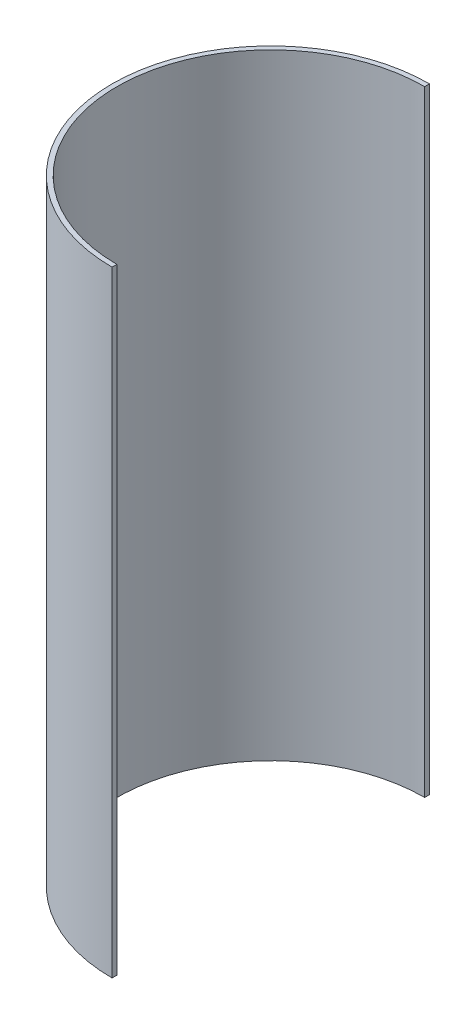
ISO-10303-21;
HEADER;
FILE_DESCRIPTION(('STEP AP214'),'2;1');
FILE_NAME('part.step','',(''),(''),'','','');
FILE_SCHEMA(('AUTOMOTIVE_DESIGN { 1 0 10303 214 1 1 1 1 }'));
ENDSEC;
DATA;
#1=APPLICATION_CONTEXT('core data for automotive mechanical design processes');
#2=APPLICATION_PROTOCOL_DEFINITION('international standard','automotive_design',2000,#1);
#3=PRODUCT_CONTEXT('',#1,'mechanical');
#4=PRODUCT('Part','Part','',(#3));
#5=PRODUCT_RELATED_PRODUCT_CATEGORY('part','',(#4));
#6=PRODUCT_DEFINITION_FORMATION('','',#4);
#7=PRODUCT_DEFINITION_CONTEXT('part definition',#1,'design');
#8=PRODUCT_DEFINITION('design','',#6,#7);
#9=PRODUCT_DEFINITION_SHAPE('','',#8);
#10=(LENGTH_UNIT() NAMED_UNIT(*) SI_UNIT(.MILLI.,.METRE.));
#11=(NAMED_UNIT(*) PLANE_ANGLE_UNIT() SI_UNIT($,.RADIAN.));
#12=(NAMED_UNIT(*) SI_UNIT($,.STERADIAN.) SOLID_ANGLE_UNIT());
#13=UNCERTAINTY_MEASURE_WITH_UNIT(LENGTH_MEASURE(1.E-05),#10,'distance_accuracy_value','');
#14=(GEOMETRIC_REPRESENTATION_CONTEXT(3) GLOBAL_UNCERTAINTY_ASSIGNED_CONTEXT((#13)) GLOBAL_UNIT_ASSIGNED_CONTEXT((#10,
#11,#12)) REPRESENTATION_CONTEXT('',''));
#15=CARTESIAN_POINT('',(0.,0.,0.));
#16=DIRECTION('',(0.,0.,1.));
#17=DIRECTION('',(1.,0.,0.));
#18=AXIS2_PLACEMENT_3D('',#15,#16,#17);
#19=CARTESIAN_POINT('',(0.,406.4,0.));
#20=DIRECTION('',(0.,-1.,0.));
#21=DIRECTION('',(0.,0.,-1.));
#22=AXIS2_PLACEMENT_3D('',#19,#20,#21);
#23=CYLINDRICAL_SURFACE('',#22,101.6);
#24=CARTESIAN_POINT('',(0.,0.,0.));
#25=DIRECTION('',(0.,-1.,0.));
#26=DIRECTION('',(0.,0.,1.));
#27=AXIS2_PLACEMENT_3D('',#24,#25,#26);
#28=CIRCLE('',#27,101.6);
#29=CARTESIAN_POINT('',(0.,0.,101.6));
#30=VERTEX_POINT('',#29);
#31=CARTESIAN_POINT('',(0.,0.,-101.6));
#32=VERTEX_POINT('',#31);
#33=EDGE_CURVE('E96',#30,#32,#28,.T.);
#34=ORIENTED_EDGE('',*,*,#33,.T.);
#35=DIRECTION('',(0.,-1.,0.));
#36=VECTOR('',#35,1.);
#37=CARTESIAN_POINT('',(0.,406.4,-101.6));
#38=LINE('',#37,#36);
#39=CARTESIAN_POINT('',(0.,406.4,-101.6));
#40=VERTEX_POINT('',#39);
#41=EDGE_CURVE('E11',#40,#32,#38,.T.);
#42=ORIENTED_EDGE('',*,*,#41,.F.);
#43=CARTESIAN_POINT('',(0.,406.4,0.));
#44=DIRECTION('',(0.,-1.,0.));
#45=DIRECTION('',(0.,0.,1.));
#46=AXIS2_PLACEMENT_3D('',#43,#44,#45);
#47=CIRCLE('',#46,101.6);
#48=CARTESIAN_POINT('',(0.,406.4,101.6));
#49=VERTEX_POINT('',#48);
#50=EDGE_CURVE('E84',#49,#40,#47,.T.);
#51=ORIENTED_EDGE('',*,*,#50,.F.);
#52=DIRECTION('',(0.,-1.,0.));
#53=VECTOR('',#52,1.);
#54=CARTESIAN_POINT('',(0.,406.4,101.6));
#55=LINE('',#54,#53);
#56=EDGE_CURVE('E92',#49,#30,#55,.T.);
#57=ORIENTED_EDGE('',*,*,#56,.T.);
#58=EDGE_LOOP('',(#34,#42,#51,#57));
#59=FACE_BOUND('',#58,.T.);
#60=ADVANCED_FACE('F33',(#59),#23,.F.);
#61=CARTESIAN_POINT('',(0.,406.4,-101.6));
#62=DIRECTION('',(-1.,0.,0.));
#63=DIRECTION('',(0.,0.,1.));
#64=AXIS2_PLACEMENT_3D('',#61,#62,#63);
#65=PLANE('',#64);
#66=DIRECTION('',(0.,0.,-1.));
#67=VECTOR('',#66,1.);
#68=CARTESIAN_POINT('',(0.,0.,-101.6));
#69=LINE('',#68,#67);
#70=CARTESIAN_POINT('',(0.,0.,-104.775));
#71=VERTEX_POINT('',#70);
#72=EDGE_CURVE('E88',#32,#71,#69,.T.);
#73=ORIENTED_EDGE('',*,*,#72,.T.);
#74=DIRECTION('',(0.,-1.,0.));
#75=VECTOR('',#74,1.);
#76=CARTESIAN_POINT('',(0.,406.4,-104.775));
#77=LINE('',#76,#75);
#78=CARTESIAN_POINT('',(0.,406.4,-104.775));
#79=VERTEX_POINT('',#78);
#80=EDGE_CURVE('E41',#79,#71,#77,.T.);
#81=ORIENTED_EDGE('',*,*,#80,.F.);
#82=DIRECTION('',(0.,0.,-1.));
#83=VECTOR('',#82,1.);
#84=CARTESIAN_POINT('',(0.,406.4,-101.6));
#85=LINE('',#84,#83);
#86=EDGE_CURVE('E79',#40,#79,#85,.T.);
#87=ORIENTED_EDGE('',*,*,#86,.F.);
#88=ORIENTED_EDGE('',*,*,#41,.T.);
#89=EDGE_LOOP('',(#73,#81,#87,#88));
#90=FACE_BOUND('',#89,.T.);
#91=ADVANCED_FACE('F87',(#90),#65,.F.);
#92=CARTESIAN_POINT('',(0.,406.4,0.));
#93=DIRECTION('',(0.,-1.,0.));
#94=DIRECTION('',(0.,0.,-1.));
#95=AXIS2_PLACEMENT_3D('',#92,#93,#94);
#96=CYLINDRICAL_SURFACE('',#95,104.775);
#97=CARTESIAN_POINT('',(0.,0.,0.));
#98=DIRECTION('',(0.,1.,0.));
#99=DIRECTION('',(0.,0.,1.));
#100=AXIS2_PLACEMENT_3D('',#97,#98,#99);
#101=CIRCLE('',#100,104.775);
#102=CARTESIAN_POINT('',(0.,0.,104.775));
#103=VERTEX_POINT('',#102);
#104=EDGE_CURVE('E66',#71,#103,#101,.T.);
#105=ORIENTED_EDGE('',*,*,#104,.T.);
#106=DIRECTION('',(0.,-1.,0.));
#107=VECTOR('',#106,1.);
#108=CARTESIAN_POINT('',(0.,406.4,104.775));
#109=LINE('',#108,#107);
#110=CARTESIAN_POINT('',(0.,406.4,104.775));
#111=VERTEX_POINT('',#110);
#112=EDGE_CURVE('E89',#111,#103,#109,.T.);
#113=ORIENTED_EDGE('',*,*,#112,.F.);
#114=CARTESIAN_POINT('',(0.,406.4,0.));
#115=DIRECTION('',(0.,1.,0.));
#116=DIRECTION('',(0.,0.,1.));
#117=AXIS2_PLACEMENT_3D('',#114,#115,#116);
#118=CIRCLE('',#117,104.775);
#119=EDGE_CURVE('E82',#79,#111,#118,.T.);
#120=ORIENTED_EDGE('',*,*,#119,.F.);
#121=ORIENTED_EDGE('',*,*,#80,.T.);
#122=EDGE_LOOP('',(#105,#113,#120,#121));
#123=FACE_BOUND('',#122,.T.);
#124=ADVANCED_FACE('F90',(#123),#96,.T.);
#125=CARTESIAN_POINT('',(0.,406.4,104.775));
#126=DIRECTION('',(-1.,0.,0.));
#127=DIRECTION('',(0.,0.,1.));
#128=AXIS2_PLACEMENT_3D('',#125,#126,#127);
#129=PLANE('',#128);
#130=DIRECTION('',(0.,0.,-1.));
#131=VECTOR('',#130,1.);
#132=CARTESIAN_POINT('',(0.,0.,104.775));
#133=LINE('',#132,#131);
#134=EDGE_CURVE('E72',#103,#30,#133,.T.);
#135=ORIENTED_EDGE('',*,*,#134,.T.);
#136=ORIENTED_EDGE('',*,*,#56,.F.);
#137=DIRECTION('',(0.,0.,-1.));
#138=VECTOR('',#137,1.);
#139=CARTESIAN_POINT('',(0.,406.4,104.775));
#140=LINE('',#139,#138);
#141=EDGE_CURVE('E49',#111,#49,#140,.T.);
#142=ORIENTED_EDGE('',*,*,#141,.F.);
#143=ORIENTED_EDGE('',*,*,#112,.T.);
#144=EDGE_LOOP('',(#135,#136,#142,#143));
#145=FACE_BOUND('',#144,.T.);
#146=ADVANCED_FACE('F103',(#145),#129,.F.);
#147=CARTESIAN_POINT('',(0.,406.4,0.));
#148=DIRECTION('',(0.,1.,0.));
#149=DIRECTION('',(0.,0.,1.));
#150=AXIS2_PLACEMENT_3D('',#147,#148,#149);
#151=PLANE('',#150);
#152=ORIENTED_EDGE('',*,*,#50,.T.);
#153=ORIENTED_EDGE('',*,*,#86,.T.);
#154=ORIENTED_EDGE('',*,*,#119,.T.);
#155=ORIENTED_EDGE('',*,*,#141,.T.);
#156=EDGE_LOOP('',(#152,#153,#154,#155));
#157=FACE_BOUND('',#156,.T.);
#158=ADVANCED_FACE('F80',(#157),#151,.T.);
#159=CARTESIAN_POINT('',(0.,0.,0.));
#160=DIRECTION('',(0.,1.,0.));
#161=DIRECTION('',(0.,0.,1.));
#162=AXIS2_PLACEMENT_3D('',#159,#160,#161);
#163=PLANE('',#162);
#164=ORIENTED_EDGE('',*,*,#33,.F.);
#165=ORIENTED_EDGE('',*,*,#134,.F.);
#166=ORIENTED_EDGE('',*,*,#104,.F.);
#167=ORIENTED_EDGE('',*,*,#72,.F.);
#168=EDGE_LOOP('',(#164,#165,#166,#167));
#169=FACE_BOUND('',#168,.T.);
#170=ADVANCED_FACE('F106',(#169),#163,.F.);
#171=CLOSED_SHELL('',(#60,#91,#124,#146,#158,#170));
#172=MANIFOLD_SOLID_BREP('B2',#171);
#173=ADVANCED_BREP_SHAPE_REPRESENTATION('',(#18,#172),#14);
#174=SHAPE_DEFINITION_REPRESENTATION(#9,#173);
ENDSEC;
END-ISO-10303-21;
